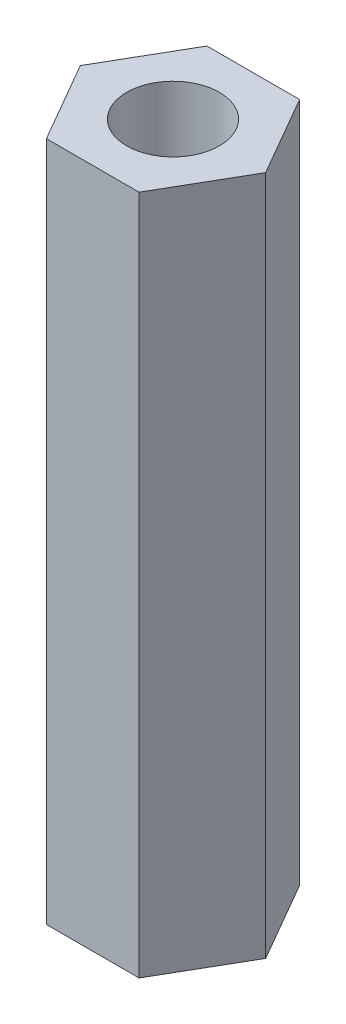
ISO-10303-21;
HEADER;
FILE_DESCRIPTION(('STEP AP214'),'2;1');
FILE_NAME('part.step','',(''),(''),'','','');
FILE_SCHEMA(('AUTOMOTIVE_DESIGN { 1 0 10303 214 1 1 1 1 }'));
ENDSEC;
DATA;
#1=APPLICATION_CONTEXT('core data for automotive mechanical design processes');
#2=APPLICATION_PROTOCOL_DEFINITION('international standard','automotive_design',2000,#1);
#3=PRODUCT_CONTEXT('',#1,'mechanical');
#4=PRODUCT('Part','Part','',(#3));
#5=PRODUCT_RELATED_PRODUCT_CATEGORY('part','',(#4));
#6=PRODUCT_DEFINITION_FORMATION('','',#4);
#7=PRODUCT_DEFINITION_CONTEXT('part definition',#1,'design');
#8=PRODUCT_DEFINITION('design','',#6,#7);
#9=PRODUCT_DEFINITION_SHAPE('','',#8);
#10=(LENGTH_UNIT() NAMED_UNIT(*) SI_UNIT(.MILLI.,.METRE.));
#11=(NAMED_UNIT(*) PLANE_ANGLE_UNIT() SI_UNIT($,.RADIAN.));
#12=(NAMED_UNIT(*) SI_UNIT($,.STERADIAN.) SOLID_ANGLE_UNIT());
#13=UNCERTAINTY_MEASURE_WITH_UNIT(LENGTH_MEASURE(1.E-05),#10,'distance_accuracy_value','');
#14=(GEOMETRIC_REPRESENTATION_CONTEXT(3) GLOBAL_UNCERTAINTY_ASSIGNED_CONTEXT((#13)) GLOBAL_UNIT_ASSIGNED_CONTEXT((#10,
#11,#12)) REPRESENTATION_CONTEXT('',''));
#15=CARTESIAN_POINT('',(0.,0.,0.));
#16=DIRECTION('',(0.,0.,1.));
#17=DIRECTION('',(1.,0.,0.));
#18=AXIS2_PLACEMENT_3D('',#15,#16,#17);
#19=CARTESIAN_POINT('',(0.,22.,0.));
#20=DIRECTION('',(0.,1.,0.));
#21=DIRECTION('',(0.,0.,1.));
#22=AXIS2_PLACEMENT_3D('',#19,#20,#21);
#23=PLANE('',#22);
#24=DIRECTION('',(0.499999999999995,0.,-0.866025403784442));
#25=VECTOR('',#24,1.);
#26=CARTESIAN_POINT('',(1.498005275015,22.,2.5946212463321));
#27=LINE('',#26,#25);
#28=CARTESIAN_POINT('',(1.498005275015,22.,2.5946212463321));
#29=VERTEX_POINT('',#28);
#30=CARTESIAN_POINT('',(2.99601055002994,22.,0.));
#31=VERTEX_POINT('',#30);
#32=EDGE_CURVE('E131',#29,#31,#27,.T.);
#33=ORIENTED_EDGE('',*,*,#32,.T.);
#34=DIRECTION('',(-0.500000000000001,0.,-0.866025403784438));
#35=VECTOR('',#34,1.);
#36=CARTESIAN_POINT('',(2.99601055002994,22.,0.));
#37=LINE('',#36,#35);
#38=CARTESIAN_POINT('',(1.49800527501496,22.,-2.59462124633212));
#39=VERTEX_POINT('',#38);
#40=EDGE_CURVE('E89',#31,#39,#37,.T.);
#41=ORIENTED_EDGE('',*,*,#40,.T.);
#42=DIRECTION('',(-1.,0.,0.));
#43=VECTOR('',#42,1.);
#44=CARTESIAN_POINT('',(1.49800527501496,22.,-2.59462124633212));
#45=LINE('',#44,#43);
#46=CARTESIAN_POINT('',(-1.49800527501498,22.,-2.59462124633211));
#47=VERTEX_POINT('',#46);
#48=EDGE_CURVE('E102',#39,#47,#45,.T.);
#49=ORIENTED_EDGE('',*,*,#48,.T.);
#50=DIRECTION('',(-0.499999999999995,0.,0.866025403784441));
#51=VECTOR('',#50,1.);
#52=CARTESIAN_POINT('',(-1.49800527501498,22.,-2.59462124633211));
#53=LINE('',#52,#51);
#54=CARTESIAN_POINT('',(-2.99601055002994,22.,0.));
#55=VERTEX_POINT('',#54);
#56=EDGE_CURVE('E96',#47,#55,#53,.T.);
#57=ORIENTED_EDGE('',*,*,#56,.T.);
#58=DIRECTION('',(0.500000000000007,0.,0.866025403784435));
#59=VECTOR('',#58,1.);
#60=CARTESIAN_POINT('',(-2.99601055002994,22.,0.));
#61=LINE('',#60,#59);
#62=CARTESIAN_POINT('',(-1.49800527501495,22.,2.59462124633213));
#63=VERTEX_POINT('',#62);
#64=EDGE_CURVE('E100',#55,#63,#61,.T.);
#65=ORIENTED_EDGE('',*,*,#64,.T.);
#66=DIRECTION('',(1.,0.,0.));
#67=VECTOR('',#66,1.);
#68=CARTESIAN_POINT('',(-1.49800527501495,22.,2.59462124633213));
#69=LINE('',#68,#67);
#70=EDGE_CURVE('E52',#63,#29,#69,.T.);
#71=ORIENTED_EDGE('',*,*,#70,.T.);
#72=EDGE_LOOP('',(#33,#41,#49,#57,#65,#71));
#73=FACE_BOUND('',#72,.T.);
#74=CARTESIAN_POINT('',(0.,22.,0.));
#75=DIRECTION('',(0.,1.,0.));
#76=DIRECTION('',(0.,0.,1.));
#77=AXIS2_PLACEMENT_3D('',#74,#75,#76);
#78=CIRCLE('',#77,1.5);
#79=CARTESIAN_POINT('',(0.,22.,1.5));
#80=VERTEX_POINT('',#79);
#81=EDGE_CURVE('E124',#80,#80,#78,.T.);
#82=ORIENTED_EDGE('',*,*,#81,.F.);
#83=EDGE_LOOP('',(#82));
#84=FACE_BOUND('',#83,.T.);
#85=ADVANCED_FACE('F35',(#73,#84),#23,.T.);
#86=CARTESIAN_POINT('',(0.,0.,0.));
#87=DIRECTION('',(0.,1.,0.));
#88=DIRECTION('',(0.,0.,1.));
#89=AXIS2_PLACEMENT_3D('',#86,#87,#88);
#90=PLANE('',#89);
#91=DIRECTION('',(0.499999999999995,0.,-0.866025403784442));
#92=VECTOR('',#91,1.);
#93=CARTESIAN_POINT('',(1.498005275015,0.,2.5946212463321));
#94=LINE('',#93,#92);
#95=CARTESIAN_POINT('',(1.498005275015,0.,2.5946212463321));
#96=VERTEX_POINT('',#95);
#97=CARTESIAN_POINT('',(2.99601055002994,0.,0.));
#98=VERTEX_POINT('',#97);
#99=EDGE_CURVE('E120',#96,#98,#94,.T.);
#100=ORIENTED_EDGE('',*,*,#99,.F.);
#101=DIRECTION('',(1.,0.,0.));
#102=VECTOR('',#101,1.);
#103=CARTESIAN_POINT('',(-1.49800527501495,0.,2.59462124633213));
#104=LINE('',#103,#102);
#105=CARTESIAN_POINT('',(-1.49800527501495,0.,2.59462124633213));
#106=VERTEX_POINT('',#105);
#107=EDGE_CURVE('E81',#106,#96,#104,.T.);
#108=ORIENTED_EDGE('',*,*,#107,.F.);
#109=DIRECTION('',(0.500000000000007,0.,0.866025403784435));
#110=VECTOR('',#109,1.);
#111=CARTESIAN_POINT('',(-2.99601055002994,0.,0.));
#112=LINE('',#111,#110);
#113=CARTESIAN_POINT('',(-2.99601055002994,0.,0.));
#114=VERTEX_POINT('',#113);
#115=EDGE_CURVE('E75',#114,#106,#112,.T.);
#116=ORIENTED_EDGE('',*,*,#115,.F.);
#117=DIRECTION('',(-0.499999999999995,0.,0.866025403784441));
#118=VECTOR('',#117,1.);
#119=CARTESIAN_POINT('',(-1.49800527501498,0.,-2.59462124633211));
#120=LINE('',#119,#118);
#121=CARTESIAN_POINT('',(-1.49800527501498,0.,-2.59462124633211));
#122=VERTEX_POINT('',#121);
#123=EDGE_CURVE('E110',#122,#114,#120,.T.);
#124=ORIENTED_EDGE('',*,*,#123,.F.);
#125=DIRECTION('',(-1.,0.,0.));
#126=VECTOR('',#125,1.);
#127=CARTESIAN_POINT('',(1.49800527501496,0.,-2.59462124633212));
#128=LINE('',#127,#126);
#129=CARTESIAN_POINT('',(1.49800527501496,0.,-2.59462124633212));
#130=VERTEX_POINT('',#129);
#131=EDGE_CURVE('E126',#130,#122,#128,.T.);
#132=ORIENTED_EDGE('',*,*,#131,.F.);
#133=DIRECTION('',(-0.500000000000001,0.,-0.866025403784438));
#134=VECTOR('',#133,1.);
#135=CARTESIAN_POINT('',(2.99601055002994,0.,0.));
#136=LINE('',#135,#134);
#137=EDGE_CURVE('E123',#98,#130,#136,.T.);
#138=ORIENTED_EDGE('',*,*,#137,.F.);
#139=EDGE_LOOP('',(#100,#108,#116,#124,#132,#138));
#140=FACE_BOUND('',#139,.T.);
#141=CARTESIAN_POINT('',(0.,0.,0.));
#142=DIRECTION('',(0.,1.,0.));
#143=DIRECTION('',(0.,0.,1.));
#144=AXIS2_PLACEMENT_3D('',#141,#142,#143);
#145=CIRCLE('',#144,1.5);
#146=CARTESIAN_POINT('',(0.,0.,1.5));
#147=VERTEX_POINT('',#146);
#148=EDGE_CURVE('E224',#147,#147,#145,.T.);
#149=ORIENTED_EDGE('',*,*,#148,.T.);
#150=EDGE_LOOP('',(#149));
#151=FACE_BOUND('',#150,.T.);
#152=ADVANCED_FACE('F140',(#140,#151),#90,.F.);
#153=CARTESIAN_POINT('',(1.498005275015,22.,2.5946212463321));
#154=DIRECTION('',(-0.866025403784441,0.,-0.499999999999995));
#155=DIRECTION('',(-0.499999999999995,0.,0.866025403784441));
#156=AXIS2_PLACEMENT_3D('',#153,#154,#155);
#157=PLANE('',#156);
#158=ORIENTED_EDGE('',*,*,#99,.T.);
#159=DIRECTION('',(0.,-1.,0.));
#160=VECTOR('',#159,1.);
#161=CARTESIAN_POINT('',(2.99601055002994,22.,0.));
#162=LINE('',#161,#160);
#163=EDGE_CURVE('E11',#31,#98,#162,.T.);
#164=ORIENTED_EDGE('',*,*,#163,.F.);
#165=ORIENTED_EDGE('',*,*,#32,.F.);
#166=DIRECTION('',(0.,-1.,0.));
#167=VECTOR('',#166,1.);
#168=CARTESIAN_POINT('',(1.498005275015,22.,2.5946212463321));
#169=LINE('',#168,#167);
#170=EDGE_CURVE('E116',#29,#96,#169,.T.);
#171=ORIENTED_EDGE('',*,*,#170,.T.);
#172=EDGE_LOOP('',(#158,#164,#165,#171));
#173=FACE_BOUND('',#172,.T.);
#174=ADVANCED_FACE('F37',(#173),#157,.F.);
#175=CARTESIAN_POINT('',(2.99601055002994,22.,0.));
#176=DIRECTION('',(-0.866025403784438,0.,0.500000000000001));
#177=DIRECTION('',(0.500000000000001,0.,0.866025403784438));
#178=AXIS2_PLACEMENT_3D('',#175,#176,#177);
#179=PLANE('',#178);
#180=ORIENTED_EDGE('',*,*,#137,.T.);
#181=DIRECTION('',(0.,-1.,0.));
#182=VECTOR('',#181,1.);
#183=CARTESIAN_POINT('',(1.49800527501496,22.,-2.59462124633212));
#184=LINE('',#183,#182);
#185=EDGE_CURVE('E44',#39,#130,#184,.T.);
#186=ORIENTED_EDGE('',*,*,#185,.F.);
#187=ORIENTED_EDGE('',*,*,#40,.F.);
#188=ORIENTED_EDGE('',*,*,#163,.T.);
#189=EDGE_LOOP('',(#180,#186,#187,#188));
#190=FACE_BOUND('',#189,.T.);
#191=ADVANCED_FACE('F165',(#190),#179,.F.);
#192=CARTESIAN_POINT('',(1.49800527501496,22.,-2.59462124633212));
#193=DIRECTION('',(0.,0.,1.));
#194=DIRECTION('',(1.,0.,0.));
#195=AXIS2_PLACEMENT_3D('',#192,#193,#194);
#196=PLANE('',#195);
#197=ORIENTED_EDGE('',*,*,#131,.T.);
#198=DIRECTION('',(0.,-1.,0.));
#199=VECTOR('',#198,1.);
#200=CARTESIAN_POINT('',(-1.49800527501498,22.,-2.59462124633211));
#201=LINE('',#200,#199);
#202=EDGE_CURVE('E111',#47,#122,#201,.T.);
#203=ORIENTED_EDGE('',*,*,#202,.F.);
#204=ORIENTED_EDGE('',*,*,#48,.F.);
#205=ORIENTED_EDGE('',*,*,#185,.T.);
#206=EDGE_LOOP('',(#197,#203,#204,#205));
#207=FACE_BOUND('',#206,.T.);
#208=ADVANCED_FACE('F137',(#207),#196,.F.);
#209=CARTESIAN_POINT('',(-1.49800527501498,22.,-2.59462124633211));
#210=DIRECTION('',(0.866025403784442,0.,0.499999999999995));
#211=DIRECTION('',(0.499999999999995,0.,-0.866025403784442));
#212=AXIS2_PLACEMENT_3D('',#209,#210,#211);
#213=PLANE('',#212);
#214=ORIENTED_EDGE('',*,*,#123,.T.);
#215=DIRECTION('',(0.,-1.,0.));
#216=VECTOR('',#215,1.);
#217=CARTESIAN_POINT('',(-2.99601055002994,22.,0.));
#218=LINE('',#217,#216);
#219=EDGE_CURVE('E107',#55,#114,#218,.T.);
#220=ORIENTED_EDGE('',*,*,#219,.F.);
#221=ORIENTED_EDGE('',*,*,#56,.F.);
#222=ORIENTED_EDGE('',*,*,#202,.T.);
#223=EDGE_LOOP('',(#214,#220,#221,#222));
#224=FACE_BOUND('',#223,.T.);
#225=ADVANCED_FACE('F108',(#224),#213,.F.);
#226=CARTESIAN_POINT('',(-2.99601055002994,22.,0.));
#227=DIRECTION('',(0.866025403784435,0.,-0.500000000000007));
#228=DIRECTION('',(-0.500000000000007,0.,-0.866025403784434));
#229=AXIS2_PLACEMENT_3D('',#226,#227,#228);
#230=PLANE('',#229);
#231=ORIENTED_EDGE('',*,*,#115,.T.);
#232=DIRECTION('',(0.,-1.,0.));
#233=VECTOR('',#232,1.);
#234=CARTESIAN_POINT('',(-1.49800527501495,22.,2.59462124633213));
#235=LINE('',#234,#233);
#236=EDGE_CURVE('E112',#63,#106,#235,.T.);
#237=ORIENTED_EDGE('',*,*,#236,.F.);
#238=ORIENTED_EDGE('',*,*,#64,.F.);
#239=ORIENTED_EDGE('',*,*,#219,.T.);
#240=EDGE_LOOP('',(#231,#237,#238,#239));
#241=FACE_BOUND('',#240,.T.);
#242=ADVANCED_FACE('F114',(#241),#230,.F.);
#243=CARTESIAN_POINT('',(-1.49800527501495,22.,2.59462124633213));
#244=DIRECTION('',(0.,0.,-1.));
#245=DIRECTION('',(-1.,0.,0.));
#246=AXIS2_PLACEMENT_3D('',#243,#244,#245);
#247=PLANE('',#246);
#248=ORIENTED_EDGE('',*,*,#107,.T.);
#249=ORIENTED_EDGE('',*,*,#170,.F.);
#250=ORIENTED_EDGE('',*,*,#70,.F.);
#251=ORIENTED_EDGE('',*,*,#236,.T.);
#252=EDGE_LOOP('',(#248,#249,#250,#251));
#253=FACE_BOUND('',#252,.T.);
#254=ADVANCED_FACE('F145',(#253),#247,.F.);
#255=CARTESIAN_POINT('',(0.,22.,0.));
#256=DIRECTION('',(0.,-1.,0.));
#257=DIRECTION('',(0.,0.,-1.));
#258=AXIS2_PLACEMENT_3D('',#255,#256,#257);
#259=CYLINDRICAL_SURFACE('',#258,1.5);
#260=ORIENTED_EDGE('',*,*,#81,.T.);
#261=EDGE_LOOP('',(#260));
#262=FACE_BOUND('',#261,.T.);
#263=ORIENTED_EDGE('',*,*,#148,.F.);
#264=EDGE_LOOP('',(#263));
#265=FACE_BOUND('',#264,.T.);
#266=ADVANCED_FACE('F147',(#262,#265),#259,.F.);
#267=CLOSED_SHELL('',(#85,#152,#174,#191,#208,#225,#242,#254,#266));
#268=MANIFOLD_SOLID_BREP('B2',#267);
#269=ADVANCED_BREP_SHAPE_REPRESENTATION('',(#18,#268),#14);
#270=SHAPE_DEFINITION_REPRESENTATION(#9,#269);
ENDSEC;
END-ISO-10303-21;
